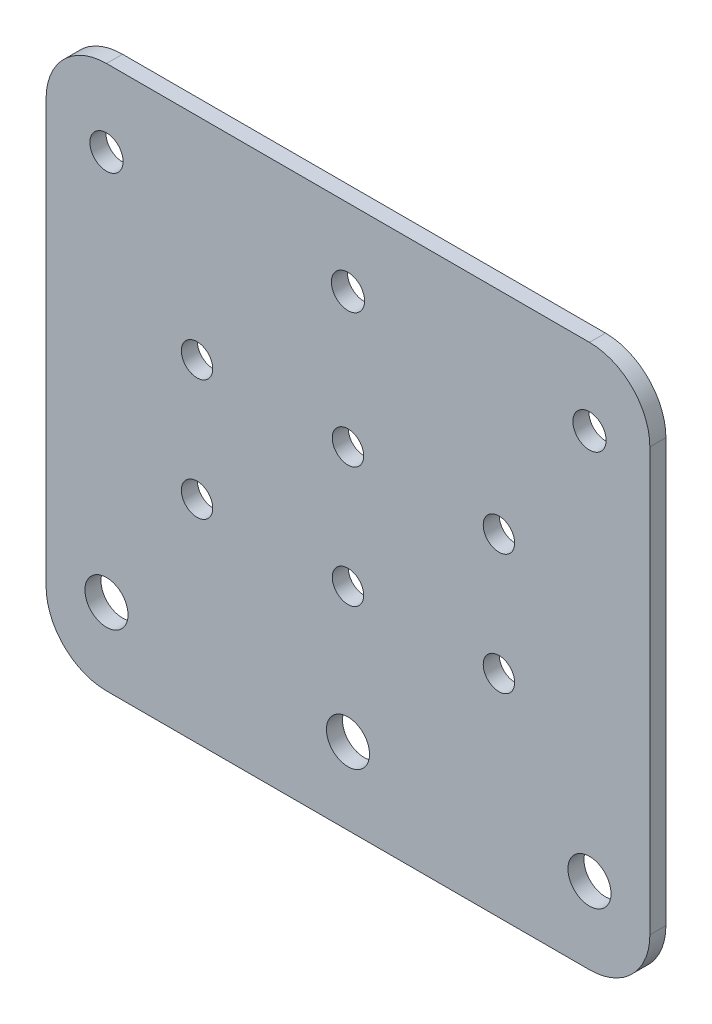
ISO-10303-21;
HEADER;
FILE_DESCRIPTION(('STEP AP214'),'2;1');
FILE_NAME('part.step','',(''),(''),'','','');
FILE_SCHEMA(('AUTOMOTIVE_DESIGN { 1 0 10303 214 1 1 1 1 }'));
ENDSEC;
DATA;
#1=APPLICATION_CONTEXT('core data for automotive mechanical design processes');
#2=APPLICATION_PROTOCOL_DEFINITION('international standard','automotive_design',2000,#1);
#3=PRODUCT_CONTEXT('',#1,'mechanical');
#4=PRODUCT('Part','Part','',(#3));
#5=PRODUCT_RELATED_PRODUCT_CATEGORY('part','',(#4));
#6=PRODUCT_DEFINITION_FORMATION('','',#4);
#7=PRODUCT_DEFINITION_CONTEXT('part definition',#1,'design');
#8=PRODUCT_DEFINITION('design','',#6,#7);
#9=PRODUCT_DEFINITION_SHAPE('','',#8);
#10=(LENGTH_UNIT() NAMED_UNIT(*) SI_UNIT(.MILLI.,.METRE.));
#11=(NAMED_UNIT(*) PLANE_ANGLE_UNIT() SI_UNIT($,.RADIAN.));
#12=(NAMED_UNIT(*) SI_UNIT($,.STERADIAN.) SOLID_ANGLE_UNIT());
#13=UNCERTAINTY_MEASURE_WITH_UNIT(LENGTH_MEASURE(1.E-05),#10,'distance_accuracy_value','');
#14=(GEOMETRIC_REPRESENTATION_CONTEXT(3) GLOBAL_UNCERTAINTY_ASSIGNED_CONTEXT((#13)) GLOBAL_UNIT_ASSIGNED_CONTEXT((#10,
#11,#12)) REPRESENTATION_CONTEXT('',''));
#15=CARTESIAN_POINT('',(0.,0.,0.));
#16=DIRECTION('',(0.,0.,1.));
#17=DIRECTION('',(1.,0.,0.));
#18=AXIS2_PLACEMENT_3D('',#15,#16,#17);
#19=CARTESIAN_POINT('',(0.,0.,2.65684));
#20=DIRECTION('',(0.,0.,1.));
#21=DIRECTION('',(1.,0.,0.));
#22=AXIS2_PLACEMENT_3D('',#19,#20,#21);
#23=PLANE('',#22);
#24=CARTESIAN_POINT('',(-40.,35.,2.65684));
#25=DIRECTION('',(0.,0.,1.));
#26=DIRECTION('',(1.,0.,0.));
#27=AXIS2_PLACEMENT_3D('',#24,#25,#26);
#28=CIRCLE('',#27,10.);
#29=CARTESIAN_POINT('',(-50.,35.,2.65684));
#30=VERTEX_POINT('',#29);
#31=CARTESIAN_POINT('',(-40.,45.,2.65684));
#32=VERTEX_POINT('',#31);
#33=EDGE_CURVE('E166',#30,#32,#28,.F.);
#34=ORIENTED_EDGE('',*,*,#33,.F.);
#35=DIRECTION('',(0.,1.,0.));
#36=VECTOR('',#35,1.);
#37=CARTESIAN_POINT('',(-50.,-45.,2.65684));
#38=LINE('',#37,#36);
#39=CARTESIAN_POINT('',(-50.,-35.,2.65684));
#40=VERTEX_POINT('',#39);
#41=EDGE_CURVE('E108',#40,#30,#38,.T.);
#42=ORIENTED_EDGE('',*,*,#41,.F.);
#43=CARTESIAN_POINT('',(-40.,-35.,2.65684));
#44=DIRECTION('',(0.,0.,1.));
#45=DIRECTION('',(1.,0.,0.));
#46=AXIS2_PLACEMENT_3D('',#43,#44,#45);
#47=CIRCLE('',#46,10.);
#48=CARTESIAN_POINT('',(-40.,-45.,2.65684));
#49=VERTEX_POINT('',#48);
#50=EDGE_CURVE('E94',#49,#40,#47,.F.);
#51=ORIENTED_EDGE('',*,*,#50,.F.);
#52=DIRECTION('',(1.,0.,0.));
#53=VECTOR('',#52,1.);
#54=CARTESIAN_POINT('',(50.,-45.,2.65684));
#55=LINE('',#54,#53);
#56=CARTESIAN_POINT('',(40.,-45.,2.65684));
#57=VERTEX_POINT('',#56);
#58=EDGE_CURVE('E88',#57,#49,#55,.F.);
#59=ORIENTED_EDGE('',*,*,#58,.F.);
#60=CARTESIAN_POINT('',(40.,-35.,2.65684));
#61=DIRECTION('',(0.,0.,1.));
#62=DIRECTION('',(1.,0.,0.));
#63=AXIS2_PLACEMENT_3D('',#60,#61,#62);
#64=CIRCLE('',#63,10.);
#65=CARTESIAN_POINT('',(50.,-35.,2.65684));
#66=VERTEX_POINT('',#65);
#67=EDGE_CURVE('E78',#66,#57,#64,.F.);
#68=ORIENTED_EDGE('',*,*,#67,.F.);
#69=DIRECTION('',(0.,1.,0.));
#70=VECTOR('',#69,1.);
#71=CARTESIAN_POINT('',(50.,45.,2.65684));
#72=LINE('',#71,#70);
#73=CARTESIAN_POINT('',(50.,35.,2.65684));
#74=VERTEX_POINT('',#73);
#75=EDGE_CURVE('E104',#74,#66,#72,.F.);
#76=ORIENTED_EDGE('',*,*,#75,.F.);
#77=CARTESIAN_POINT('',(40.,35.,2.65684));
#78=DIRECTION('',(0.,0.,1.));
#79=DIRECTION('',(1.,0.,0.));
#80=AXIS2_PLACEMENT_3D('',#77,#78,#79);
#81=CIRCLE('',#80,10.);
#82=CARTESIAN_POINT('',(40.,45.,2.65684));
#83=VERTEX_POINT('',#82);
#84=EDGE_CURVE('E116',#83,#74,#81,.F.);
#85=ORIENTED_EDGE('',*,*,#84,.F.);
#86=DIRECTION('',(-1.,0.,0.));
#87=VECTOR('',#86,1.);
#88=CARTESIAN_POINT('',(-50.,45.,2.65684));
#89=LINE('',#88,#87);
#90=EDGE_CURVE('E112',#32,#83,#89,.F.);
#91=ORIENTED_EDGE('',*,*,#90,.F.);
#92=EDGE_LOOP('',(#34,#42,#51,#59,#68,#76,#85,#91));
#93=FACE_BOUND('',#92,.T.);
#94=CARTESIAN_POINT('',(40.,32.3,2.65684));
#95=DIRECTION('',(0.,0.,-1.));
#96=DIRECTION('',(-1.,0.,0.));
#97=AXIS2_PLACEMENT_3D('',#94,#95,#96);
#98=CIRCLE('',#97,2.75);
#99=CARTESIAN_POINT('',(37.25,32.3,2.65684));
#100=VERTEX_POINT('',#99);
#101=EDGE_CURVE('E98',#100,#100,#98,.T.);
#102=ORIENTED_EDGE('',*,*,#101,.T.);
#103=EDGE_LOOP('',(#102));
#104=FACE_BOUND('',#103,.T.);
#105=CARTESIAN_POINT('',(40.,-32.3,2.65684));
#106=DIRECTION('',(0.,0.,-1.));
#107=DIRECTION('',(-1.,0.,0.));
#108=AXIS2_PLACEMENT_3D('',#105,#106,#107);
#109=CIRCLE('',#108,3.5685);
#110=CARTESIAN_POINT('',(36.4315,-32.3,2.65684));
#111=VERTEX_POINT('',#110);
#112=EDGE_CURVE('E171',#111,#111,#109,.T.);
#113=ORIENTED_EDGE('',*,*,#112,.T.);
#114=EDGE_LOOP('',(#113));
#115=FACE_BOUND('',#114,.T.);
#116=CARTESIAN_POINT('',(0.,32.3,2.65684));
#117=DIRECTION('',(0.,0.,-1.));
#118=DIRECTION('',(-1.,0.,0.));
#119=AXIS2_PLACEMENT_3D('',#116,#117,#118);
#120=CIRCLE('',#119,2.75);
#121=CARTESIAN_POINT('',(-2.74999999999999,32.3,2.65684));
#122=VERTEX_POINT('',#121);
#123=EDGE_CURVE('E174',#122,#122,#120,.T.);
#124=ORIENTED_EDGE('',*,*,#123,.T.);
#125=EDGE_LOOP('',(#124));
#126=FACE_BOUND('',#125,.T.);
#127=CARTESIAN_POINT('',(0.,-32.3,2.65684));
#128=DIRECTION('',(0.,0.,-1.));
#129=DIRECTION('',(-1.,0.,0.));
#130=AXIS2_PLACEMENT_3D('',#127,#128,#129);
#131=CIRCLE('',#130,3.5685);
#132=CARTESIAN_POINT('',(-3.5685,-32.3,2.65684));
#133=VERTEX_POINT('',#132);
#134=EDGE_CURVE('E177',#133,#133,#131,.T.);
#135=ORIENTED_EDGE('',*,*,#134,.T.);
#136=EDGE_LOOP('',(#135));
#137=FACE_BOUND('',#136,.T.);
#138=CARTESIAN_POINT('',(-40.,32.3,2.65684));
#139=DIRECTION('',(0.,0.,-1.));
#140=DIRECTION('',(-1.,0.,0.));
#141=AXIS2_PLACEMENT_3D('',#138,#139,#140);
#142=CIRCLE('',#141,2.75);
#143=CARTESIAN_POINT('',(-42.75,32.3,2.65684));
#144=VERTEX_POINT('',#143);
#145=EDGE_CURVE('E180',#144,#144,#142,.T.);
#146=ORIENTED_EDGE('',*,*,#145,.T.);
#147=EDGE_LOOP('',(#146));
#148=FACE_BOUND('',#147,.T.);
#149=CARTESIAN_POINT('',(-40.,-32.3,2.65684));
#150=DIRECTION('',(0.,0.,-1.));
#151=DIRECTION('',(-1.,0.,0.));
#152=AXIS2_PLACEMENT_3D('',#149,#150,#151);
#153=CIRCLE('',#152,3.5685);
#154=CARTESIAN_POINT('',(-43.5685,-32.3,2.65684));
#155=VERTEX_POINT('',#154);
#156=EDGE_CURVE('E183',#155,#155,#153,.T.);
#157=ORIENTED_EDGE('',*,*,#156,.T.);
#158=EDGE_LOOP('',(#157));
#159=FACE_BOUND('',#158,.T.);
#160=CARTESIAN_POINT('',(-25.,-10.,2.65684));
#161=DIRECTION('',(0.,0.,-1.));
#162=DIRECTION('',(-1.,0.,0.));
#163=AXIS2_PLACEMENT_3D('',#160,#161,#162);
#164=CIRCLE('',#163,2.6);
#165=CARTESIAN_POINT('',(-27.6,-10.,2.65684));
#166=VERTEX_POINT('',#165);
#167=EDGE_CURVE('E186',#166,#166,#164,.T.);
#168=ORIENTED_EDGE('',*,*,#167,.T.);
#169=EDGE_LOOP('',(#168));
#170=FACE_BOUND('',#169,.T.);
#171=CARTESIAN_POINT('',(0.,-10.,2.65684));
#172=DIRECTION('',(0.,0.,-1.));
#173=DIRECTION('',(-1.,0.,0.));
#174=AXIS2_PLACEMENT_3D('',#171,#172,#173);
#175=CIRCLE('',#174,2.6);
#176=CARTESIAN_POINT('',(-2.6,-10.,2.65684));
#177=VERTEX_POINT('',#176);
#178=EDGE_CURVE('E189',#177,#177,#175,.T.);
#179=ORIENTED_EDGE('',*,*,#178,.T.);
#180=EDGE_LOOP('',(#179));
#181=FACE_BOUND('',#180,.T.);
#182=CARTESIAN_POINT('',(25.,-10.,2.65684));
#183=DIRECTION('',(0.,0.,-1.));
#184=DIRECTION('',(-1.,0.,0.));
#185=AXIS2_PLACEMENT_3D('',#182,#183,#184);
#186=CIRCLE('',#185,2.6);
#187=CARTESIAN_POINT('',(22.4,-10.,2.65684));
#188=VERTEX_POINT('',#187);
#189=EDGE_CURVE('E192',#188,#188,#186,.T.);
#190=ORIENTED_EDGE('',*,*,#189,.T.);
#191=EDGE_LOOP('',(#190));
#192=FACE_BOUND('',#191,.T.);
#193=CARTESIAN_POINT('',(-25.,10.,2.65684));
#194=DIRECTION('',(0.,0.,-1.));
#195=DIRECTION('',(-1.,0.,0.));
#196=AXIS2_PLACEMENT_3D('',#193,#194,#195);
#197=CIRCLE('',#196,2.6);
#198=CARTESIAN_POINT('',(-27.6,10.,2.65684));
#199=VERTEX_POINT('',#198);
#200=EDGE_CURVE('E195',#199,#199,#197,.T.);
#201=ORIENTED_EDGE('',*,*,#200,.T.);
#202=EDGE_LOOP('',(#201));
#203=FACE_BOUND('',#202,.T.);
#204=CARTESIAN_POINT('',(0.,10.,2.65684));
#205=DIRECTION('',(0.,0.,-1.));
#206=DIRECTION('',(-1.,0.,0.));
#207=AXIS2_PLACEMENT_3D('',#204,#205,#206);
#208=CIRCLE('',#207,2.6);
#209=CARTESIAN_POINT('',(-2.6,10.,2.65684));
#210=VERTEX_POINT('',#209);
#211=EDGE_CURVE('E197',#210,#210,#208,.T.);
#212=ORIENTED_EDGE('',*,*,#211,.T.);
#213=EDGE_LOOP('',(#212));
#214=FACE_BOUND('',#213,.T.);
#215=CARTESIAN_POINT('',(25.,9.99999999999999,2.65684));
#216=DIRECTION('',(0.,0.,-1.));
#217=DIRECTION('',(-1.,0.,0.));
#218=AXIS2_PLACEMENT_3D('',#215,#216,#217);
#219=CIRCLE('',#218,2.6);
#220=CARTESIAN_POINT('',(22.4,9.99999999999999,2.65684));
#221=VERTEX_POINT('',#220);
#222=EDGE_CURVE('E19',#221,#221,#219,.T.);
#223=ORIENTED_EDGE('',*,*,#222,.T.);
#224=EDGE_LOOP('',(#223));
#225=FACE_BOUND('',#224,.T.);
#226=ADVANCED_FACE('F16',(#93,#104,#115,#126,#137,#148,#159,#170,#181,#192,#203,#214,#225),#23,.T.);
#227=CARTESIAN_POINT('',(25.,9.99999999999999,2.65684));
#228=DIRECTION('',(0.,0.,-1.));
#229=DIRECTION('',(-1.,0.,0.));
#230=AXIS2_PLACEMENT_3D('',#227,#228,#229);
#231=CYLINDRICAL_SURFACE('',#230,2.6);
#232=ORIENTED_EDGE('',*,*,#222,.F.);
#233=EDGE_LOOP('',(#232));
#234=FACE_BOUND('',#233,.T.);
#235=CARTESIAN_POINT('',(25.,9.99999999999999,0.));
#236=DIRECTION('',(0.,0.,-1.));
#237=DIRECTION('',(-1.,0.,0.));
#238=AXIS2_PLACEMENT_3D('',#235,#236,#237);
#239=CIRCLE('',#238,2.6);
#240=CARTESIAN_POINT('',(22.4,9.99999999999999,0.));
#241=VERTEX_POINT('',#240);
#242=EDGE_CURVE('E161',#241,#241,#239,.T.);
#243=ORIENTED_EDGE('',*,*,#242,.T.);
#244=EDGE_LOOP('',(#243));
#245=FACE_BOUND('',#244,.T.);
#246=ADVANCED_FACE('F205',(#234,#245),#231,.F.);
#247=CARTESIAN_POINT('',(0.,10.,2.65684));
#248=DIRECTION('',(0.,0.,-1.));
#249=DIRECTION('',(-1.,0.,0.));
#250=AXIS2_PLACEMENT_3D('',#247,#248,#249);
#251=CYLINDRICAL_SURFACE('',#250,2.6);
#252=ORIENTED_EDGE('',*,*,#211,.F.);
#253=EDGE_LOOP('',(#252));
#254=FACE_BOUND('',#253,.T.);
#255=CARTESIAN_POINT('',(0.,10.,0.));
#256=DIRECTION('',(0.,0.,-1.));
#257=DIRECTION('',(-1.,0.,0.));
#258=AXIS2_PLACEMENT_3D('',#255,#256,#257);
#259=CIRCLE('',#258,2.6);
#260=CARTESIAN_POINT('',(-2.6,10.,0.));
#261=VERTEX_POINT('',#260);
#262=EDGE_CURVE('E158',#261,#261,#259,.T.);
#263=ORIENTED_EDGE('',*,*,#262,.T.);
#264=EDGE_LOOP('',(#263));
#265=FACE_BOUND('',#264,.T.);
#266=ADVANCED_FACE('F208',(#254,#265),#251,.F.);
#267=CARTESIAN_POINT('',(-25.,10.,2.65684));
#268=DIRECTION('',(0.,0.,-1.));
#269=DIRECTION('',(-1.,0.,0.));
#270=AXIS2_PLACEMENT_3D('',#267,#268,#269);
#271=CYLINDRICAL_SURFACE('',#270,2.6);
#272=ORIENTED_EDGE('',*,*,#200,.F.);
#273=EDGE_LOOP('',(#272));
#274=FACE_BOUND('',#273,.T.);
#275=CARTESIAN_POINT('',(-25.,10.,0.));
#276=DIRECTION('',(0.,0.,-1.));
#277=DIRECTION('',(-1.,0.,0.));
#278=AXIS2_PLACEMENT_3D('',#275,#276,#277);
#279=CIRCLE('',#278,2.6);
#280=CARTESIAN_POINT('',(-27.6,10.,0.));
#281=VERTEX_POINT('',#280);
#282=EDGE_CURVE('E155',#281,#281,#279,.T.);
#283=ORIENTED_EDGE('',*,*,#282,.T.);
#284=EDGE_LOOP('',(#283));
#285=FACE_BOUND('',#284,.T.);
#286=ADVANCED_FACE('F283',(#274,#285),#271,.F.);
#287=CARTESIAN_POINT('',(25.,-10.,2.65684));
#288=DIRECTION('',(0.,0.,-1.));
#289=DIRECTION('',(-1.,0.,0.));
#290=AXIS2_PLACEMENT_3D('',#287,#288,#289);
#291=CYLINDRICAL_SURFACE('',#290,2.6);
#292=ORIENTED_EDGE('',*,*,#189,.F.);
#293=EDGE_LOOP('',(#292));
#294=FACE_BOUND('',#293,.T.);
#295=CARTESIAN_POINT('',(25.,-10.,0.));
#296=DIRECTION('',(0.,0.,-1.));
#297=DIRECTION('',(-1.,0.,0.));
#298=AXIS2_PLACEMENT_3D('',#295,#296,#297);
#299=CIRCLE('',#298,2.6);
#300=CARTESIAN_POINT('',(22.4,-10.,0.));
#301=VERTEX_POINT('',#300);
#302=EDGE_CURVE('E152',#301,#301,#299,.T.);
#303=ORIENTED_EDGE('',*,*,#302,.T.);
#304=EDGE_LOOP('',(#303));
#305=FACE_BOUND('',#304,.T.);
#306=ADVANCED_FACE('F279',(#294,#305),#291,.F.);
#307=CARTESIAN_POINT('',(0.,-10.,2.65684));
#308=DIRECTION('',(0.,0.,-1.));
#309=DIRECTION('',(-1.,0.,0.));
#310=AXIS2_PLACEMENT_3D('',#307,#308,#309);
#311=CYLINDRICAL_SURFACE('',#310,2.6);
#312=ORIENTED_EDGE('',*,*,#178,.F.);
#313=EDGE_LOOP('',(#312));
#314=FACE_BOUND('',#313,.T.);
#315=CARTESIAN_POINT('',(0.,-10.,0.));
#316=DIRECTION('',(0.,0.,-1.));
#317=DIRECTION('',(-1.,0.,0.));
#318=AXIS2_PLACEMENT_3D('',#315,#316,#317);
#319=CIRCLE('',#318,2.6);
#320=CARTESIAN_POINT('',(-2.6,-10.,0.));
#321=VERTEX_POINT('',#320);
#322=EDGE_CURVE('E149',#321,#321,#319,.T.);
#323=ORIENTED_EDGE('',*,*,#322,.T.);
#324=EDGE_LOOP('',(#323));
#325=FACE_BOUND('',#324,.T.);
#326=ADVANCED_FACE('F275',(#314,#325),#311,.F.);
#327=CARTESIAN_POINT('',(-25.,-10.,2.65684));
#328=DIRECTION('',(0.,0.,-1.));
#329=DIRECTION('',(-1.,0.,0.));
#330=AXIS2_PLACEMENT_3D('',#327,#328,#329);
#331=CYLINDRICAL_SURFACE('',#330,2.6);
#332=ORIENTED_EDGE('',*,*,#167,.F.);
#333=EDGE_LOOP('',(#332));
#334=FACE_BOUND('',#333,.T.);
#335=CARTESIAN_POINT('',(-25.,-10.,0.));
#336=DIRECTION('',(0.,0.,-1.));
#337=DIRECTION('',(-1.,0.,0.));
#338=AXIS2_PLACEMENT_3D('',#335,#336,#337);
#339=CIRCLE('',#338,2.6);
#340=CARTESIAN_POINT('',(-27.6,-10.,0.));
#341=VERTEX_POINT('',#340);
#342=EDGE_CURVE('E146',#341,#341,#339,.T.);
#343=ORIENTED_EDGE('',*,*,#342,.T.);
#344=EDGE_LOOP('',(#343));
#345=FACE_BOUND('',#344,.T.);
#346=ADVANCED_FACE('F271',(#334,#345),#331,.F.);
#347=CARTESIAN_POINT('',(-40.,-32.3,2.65684));
#348=DIRECTION('',(0.,0.,-1.));
#349=DIRECTION('',(-1.,0.,0.));
#350=AXIS2_PLACEMENT_3D('',#347,#348,#349);
#351=CYLINDRICAL_SURFACE('',#350,3.5685);
#352=ORIENTED_EDGE('',*,*,#156,.F.);
#353=EDGE_LOOP('',(#352));
#354=FACE_BOUND('',#353,.T.);
#355=CARTESIAN_POINT('',(-40.,-32.3,0.));
#356=DIRECTION('',(0.,0.,-1.));
#357=DIRECTION('',(-1.,0.,0.));
#358=AXIS2_PLACEMENT_3D('',#355,#356,#357);
#359=CIRCLE('',#358,3.5685);
#360=CARTESIAN_POINT('',(-43.5685,-32.3,0.));
#361=VERTEX_POINT('',#360);
#362=EDGE_CURVE('E143',#361,#361,#359,.T.);
#363=ORIENTED_EDGE('',*,*,#362,.T.);
#364=EDGE_LOOP('',(#363));
#365=FACE_BOUND('',#364,.T.);
#366=ADVANCED_FACE('F267',(#354,#365),#351,.F.);
#367=CARTESIAN_POINT('',(-40.,32.3,2.65684));
#368=DIRECTION('',(0.,0.,-1.));
#369=DIRECTION('',(-1.,0.,0.));
#370=AXIS2_PLACEMENT_3D('',#367,#368,#369);
#371=CYLINDRICAL_SURFACE('',#370,2.75);
#372=ORIENTED_EDGE('',*,*,#145,.F.);
#373=EDGE_LOOP('',(#372));
#374=FACE_BOUND('',#373,.T.);
#375=CARTESIAN_POINT('',(-40.,32.3,0.));
#376=DIRECTION('',(0.,0.,-1.));
#377=DIRECTION('',(-1.,0.,0.));
#378=AXIS2_PLACEMENT_3D('',#375,#376,#377);
#379=CIRCLE('',#378,2.75);
#380=CARTESIAN_POINT('',(-42.75,32.3,0.));
#381=VERTEX_POINT('',#380);
#382=EDGE_CURVE('E140',#381,#381,#379,.T.);
#383=ORIENTED_EDGE('',*,*,#382,.T.);
#384=EDGE_LOOP('',(#383));
#385=FACE_BOUND('',#384,.T.);
#386=ADVANCED_FACE('F263',(#374,#385),#371,.F.);
#387=CARTESIAN_POINT('',(0.,-32.3,2.65684));
#388=DIRECTION('',(0.,0.,-1.));
#389=DIRECTION('',(-1.,0.,0.));
#390=AXIS2_PLACEMENT_3D('',#387,#388,#389);
#391=CYLINDRICAL_SURFACE('',#390,3.5685);
#392=ORIENTED_EDGE('',*,*,#134,.F.);
#393=EDGE_LOOP('',(#392));
#394=FACE_BOUND('',#393,.T.);
#395=CARTESIAN_POINT('',(0.,-32.3,0.));
#396=DIRECTION('',(0.,0.,-1.));
#397=DIRECTION('',(-1.,0.,0.));
#398=AXIS2_PLACEMENT_3D('',#395,#396,#397);
#399=CIRCLE('',#398,3.5685);
#400=CARTESIAN_POINT('',(-3.5685,-32.3,0.));
#401=VERTEX_POINT('',#400);
#402=EDGE_CURVE('E137',#401,#401,#399,.T.);
#403=ORIENTED_EDGE('',*,*,#402,.T.);
#404=EDGE_LOOP('',(#403));
#405=FACE_BOUND('',#404,.T.);
#406=ADVANCED_FACE('F259',(#394,#405),#391,.F.);
#407=CARTESIAN_POINT('',(0.,32.3,2.65684));
#408=DIRECTION('',(0.,0.,-1.));
#409=DIRECTION('',(-1.,0.,0.));
#410=AXIS2_PLACEMENT_3D('',#407,#408,#409);
#411=CYLINDRICAL_SURFACE('',#410,2.75);
#412=ORIENTED_EDGE('',*,*,#123,.F.);
#413=EDGE_LOOP('',(#412));
#414=FACE_BOUND('',#413,.T.);
#415=CARTESIAN_POINT('',(0.,32.3,0.));
#416=DIRECTION('',(0.,0.,-1.));
#417=DIRECTION('',(-1.,0.,0.));
#418=AXIS2_PLACEMENT_3D('',#415,#416,#417);
#419=CIRCLE('',#418,2.75);
#420=CARTESIAN_POINT('',(-2.74999999999999,32.3,0.));
#421=VERTEX_POINT('',#420);
#422=EDGE_CURVE('E134',#421,#421,#419,.T.);
#423=ORIENTED_EDGE('',*,*,#422,.T.);
#424=EDGE_LOOP('',(#423));
#425=FACE_BOUND('',#424,.T.);
#426=ADVANCED_FACE('F255',(#414,#425),#411,.F.);
#427=CARTESIAN_POINT('',(40.,-32.3,2.65684));
#428=DIRECTION('',(0.,0.,-1.));
#429=DIRECTION('',(-1.,0.,0.));
#430=AXIS2_PLACEMENT_3D('',#427,#428,#429);
#431=CYLINDRICAL_SURFACE('',#430,3.5685);
#432=ORIENTED_EDGE('',*,*,#112,.F.);
#433=EDGE_LOOP('',(#432));
#434=FACE_BOUND('',#433,.T.);
#435=CARTESIAN_POINT('',(40.,-32.3,0.));
#436=DIRECTION('',(0.,0.,-1.));
#437=DIRECTION('',(-1.,0.,0.));
#438=AXIS2_PLACEMENT_3D('',#435,#436,#437);
#439=CIRCLE('',#438,3.5685);
#440=CARTESIAN_POINT('',(36.4315,-32.3,0.));
#441=VERTEX_POINT('',#440);
#442=EDGE_CURVE('E131',#441,#441,#439,.T.);
#443=ORIENTED_EDGE('',*,*,#442,.T.);
#444=EDGE_LOOP('',(#443));
#445=FACE_BOUND('',#444,.T.);
#446=ADVANCED_FACE('F251',(#434,#445),#431,.F.);
#447=CARTESIAN_POINT('',(40.,32.3,2.65684));
#448=DIRECTION('',(0.,0.,-1.));
#449=DIRECTION('',(-1.,0.,0.));
#450=AXIS2_PLACEMENT_3D('',#447,#448,#449);
#451=CYLINDRICAL_SURFACE('',#450,2.75);
#452=ORIENTED_EDGE('',*,*,#101,.F.);
#453=EDGE_LOOP('',(#452));
#454=FACE_BOUND('',#453,.T.);
#455=CARTESIAN_POINT('',(40.,32.3,0.));
#456=DIRECTION('',(0.,0.,-1.));
#457=DIRECTION('',(-1.,0.,0.));
#458=AXIS2_PLACEMENT_3D('',#455,#456,#457);
#459=CIRCLE('',#458,2.75);
#460=CARTESIAN_POINT('',(37.25,32.3,0.));
#461=VERTEX_POINT('',#460);
#462=EDGE_CURVE('E128',#461,#461,#459,.T.);
#463=ORIENTED_EDGE('',*,*,#462,.T.);
#464=EDGE_LOOP('',(#463));
#465=FACE_BOUND('',#464,.T.);
#466=ADVANCED_FACE('F248',(#454,#465),#451,.F.);
#467=CARTESIAN_POINT('',(50.,-45.,0.));
#468=DIRECTION('',(0.,-1.,0.));
#469=DIRECTION('',(1.,0.,0.));
#470=AXIS2_PLACEMENT_3D('',#467,#468,#469);
#471=PLANE('',#470);
#472=DIRECTION('',(0.,0.,1.));
#473=VECTOR('',#472,1.);
#474=CARTESIAN_POINT('',(40.,-45.,0.));
#475=LINE('',#474,#473);
#476=CARTESIAN_POINT('',(40.,-45.,0.));
#477=VERTEX_POINT('',#476);
#478=EDGE_CURVE('E85',#57,#477,#475,.F.);
#479=ORIENTED_EDGE('',*,*,#478,.F.);
#480=ORIENTED_EDGE('',*,*,#58,.T.);
#481=DIRECTION('',(0.,0.,1.));
#482=VECTOR('',#481,1.);
#483=CARTESIAN_POINT('',(-40.,-45.,0.));
#484=LINE('',#483,#482);
#485=CARTESIAN_POINT('',(-40.,-45.,0.));
#486=VERTEX_POINT('',#485);
#487=EDGE_CURVE('E164',#486,#49,#484,.T.);
#488=ORIENTED_EDGE('',*,*,#487,.F.);
#489=DIRECTION('',(1.,0.,0.));
#490=VECTOR('',#489,1.);
#491=CARTESIAN_POINT('',(0.,-45.,0.));
#492=LINE('',#491,#490);
#493=EDGE_CURVE('E102',#486,#477,#492,.T.);
#494=ORIENTED_EDGE('',*,*,#493,.T.);
#495=EDGE_LOOP('',(#479,#480,#488,#494));
#496=FACE_BOUND('',#495,.T.);
#497=ADVANCED_FACE('F101',(#496),#471,.T.);
#498=CARTESIAN_POINT('',(40.,-35.,0.));
#499=DIRECTION('',(0.,0.,1.));
#500=DIRECTION('',(1.,0.,0.));
#501=AXIS2_PLACEMENT_3D('',#498,#499,#500);
#502=CYLINDRICAL_SURFACE('',#501,10.);
#503=CARTESIAN_POINT('',(40.,-35.,0.));
#504=DIRECTION('',(0.,0.,1.));
#505=DIRECTION('',(1.,0.,0.));
#506=AXIS2_PLACEMENT_3D('',#503,#504,#505);
#507=CIRCLE('',#506,10.);
#508=CARTESIAN_POINT('',(50.,-35.,0.));
#509=VERTEX_POINT('',#508);
#510=EDGE_CURVE('E126',#477,#509,#507,.T.);
#511=ORIENTED_EDGE('',*,*,#510,.T.);
#512=DIRECTION('',(0.,0.,1.));
#513=VECTOR('',#512,1.);
#514=CARTESIAN_POINT('',(50.,-35.,0.));
#515=LINE('',#514,#513);
#516=EDGE_CURVE('E87',#66,#509,#515,.F.);
#517=ORIENTED_EDGE('',*,*,#516,.F.);
#518=ORIENTED_EDGE('',*,*,#67,.T.);
#519=ORIENTED_EDGE('',*,*,#478,.T.);
#520=EDGE_LOOP('',(#511,#517,#518,#519));
#521=FACE_BOUND('',#520,.T.);
#522=ADVANCED_FACE('F83',(#521),#502,.T.);
#523=CARTESIAN_POINT('',(50.,45.,0.));
#524=DIRECTION('',(1.,0.,0.));
#525=DIRECTION('',(0.,1.,0.));
#526=AXIS2_PLACEMENT_3D('',#523,#524,#525);
#527=PLANE('',#526);
#528=DIRECTION('',(0.,0.,1.));
#529=VECTOR('',#528,1.);
#530=CARTESIAN_POINT('',(50.,35.,0.));
#531=LINE('',#530,#529);
#532=CARTESIAN_POINT('',(50.,35.,0.));
#533=VERTEX_POINT('',#532);
#534=EDGE_CURVE('E115',#74,#533,#531,.F.);
#535=ORIENTED_EDGE('',*,*,#534,.F.);
#536=ORIENTED_EDGE('',*,*,#75,.T.);
#537=ORIENTED_EDGE('',*,*,#516,.T.);
#538=DIRECTION('',(0.,1.,0.));
#539=VECTOR('',#538,1.);
#540=CARTESIAN_POINT('',(50.,0.,0.));
#541=LINE('',#540,#539);
#542=EDGE_CURVE('E125',#509,#533,#541,.T.);
#543=ORIENTED_EDGE('',*,*,#542,.T.);
#544=EDGE_LOOP('',(#535,#536,#537,#543));
#545=FACE_BOUND('',#544,.T.);
#546=ADVANCED_FACE('F239',(#545),#527,.T.);
#547=CARTESIAN_POINT('',(40.,35.,0.));
#548=DIRECTION('',(0.,0.,1.));
#549=DIRECTION('',(1.,0.,0.));
#550=AXIS2_PLACEMENT_3D('',#547,#548,#549);
#551=CYLINDRICAL_SURFACE('',#550,10.);
#552=CARTESIAN_POINT('',(40.,35.,0.));
#553=DIRECTION('',(0.,0.,1.));
#554=DIRECTION('',(1.,0.,0.));
#555=AXIS2_PLACEMENT_3D('',#552,#553,#554);
#556=CIRCLE('',#555,10.);
#557=CARTESIAN_POINT('',(40.,45.,0.));
#558=VERTEX_POINT('',#557);
#559=EDGE_CURVE('E122',#533,#558,#556,.T.);
#560=ORIENTED_EDGE('',*,*,#559,.T.);
#561=DIRECTION('',(0.,0.,1.));
#562=VECTOR('',#561,1.);
#563=CARTESIAN_POINT('',(40.,45.,0.));
#564=LINE('',#563,#562);
#565=EDGE_CURVE('E114',#83,#558,#564,.F.);
#566=ORIENTED_EDGE('',*,*,#565,.F.);
#567=ORIENTED_EDGE('',*,*,#84,.T.);
#568=ORIENTED_EDGE('',*,*,#534,.T.);
#569=EDGE_LOOP('',(#560,#566,#567,#568));
#570=FACE_BOUND('',#569,.T.);
#571=ADVANCED_FACE('F235',(#570),#551,.T.);
#572=CARTESIAN_POINT('',(-50.,45.,0.));
#573=DIRECTION('',(0.,1.,0.));
#574=DIRECTION('',(-1.,0.,0.));
#575=AXIS2_PLACEMENT_3D('',#572,#573,#574);
#576=PLANE('',#575);
#577=ORIENTED_EDGE('',*,*,#565,.T.);
#578=DIRECTION('',(1.,0.,0.));
#579=VECTOR('',#578,1.);
#580=CARTESIAN_POINT('',(0.,45.,0.));
#581=LINE('',#580,#579);
#582=CARTESIAN_POINT('',(-40.,45.,0.));
#583=VERTEX_POINT('',#582);
#584=EDGE_CURVE('E121',#558,#583,#581,.F.);
#585=ORIENTED_EDGE('',*,*,#584,.T.);
#586=DIRECTION('',(0.,0.,1.));
#587=VECTOR('',#586,1.);
#588=CARTESIAN_POINT('',(-40.,45.,0.));
#589=LINE('',#588,#587);
#590=EDGE_CURVE('E111',#32,#583,#589,.F.);
#591=ORIENTED_EDGE('',*,*,#590,.F.);
#592=ORIENTED_EDGE('',*,*,#90,.T.);
#593=EDGE_LOOP('',(#577,#585,#591,#592));
#594=FACE_BOUND('',#593,.T.);
#595=ADVANCED_FACE('F231',(#594),#576,.T.);
#596=CARTESIAN_POINT('',(-40.,35.,0.));
#597=DIRECTION('',(0.,0.,1.));
#598=DIRECTION('',(1.,0.,0.));
#599=AXIS2_PLACEMENT_3D('',#596,#597,#598);
#600=CYLINDRICAL_SURFACE('',#599,10.);
#601=CARTESIAN_POINT('',(-40.,35.,0.));
#602=DIRECTION('',(0.,0.,1.));
#603=DIRECTION('',(1.,0.,0.));
#604=AXIS2_PLACEMENT_3D('',#601,#602,#603);
#605=CIRCLE('',#604,10.);
#606=CARTESIAN_POINT('',(-50.,35.,0.));
#607=VERTEX_POINT('',#606);
#608=EDGE_CURVE('E118',#583,#607,#605,.T.);
#609=ORIENTED_EDGE('',*,*,#608,.T.);
#610=DIRECTION('',(0.,0.,1.));
#611=VECTOR('',#610,1.);
#612=CARTESIAN_POINT('',(-50.,35.,0.));
#613=LINE('',#612,#611);
#614=EDGE_CURVE('E110',#30,#607,#613,.F.);
#615=ORIENTED_EDGE('',*,*,#614,.F.);
#616=ORIENTED_EDGE('',*,*,#33,.T.);
#617=ORIENTED_EDGE('',*,*,#590,.T.);
#618=EDGE_LOOP('',(#609,#615,#616,#617));
#619=FACE_BOUND('',#618,.T.);
#620=ADVANCED_FACE('F227',(#619),#600,.T.);
#621=CARTESIAN_POINT('',(-50.,-45.,0.));
#622=DIRECTION('',(-1.,0.,0.));
#623=DIRECTION('',(0.,0.,1.));
#624=AXIS2_PLACEMENT_3D('',#621,#622,#623);
#625=PLANE('',#624);
#626=ORIENTED_EDGE('',*,*,#614,.T.);
#627=DIRECTION('',(0.,1.,0.));
#628=VECTOR('',#627,1.);
#629=CARTESIAN_POINT('',(-50.,0.,0.));
#630=LINE('',#629,#628);
#631=CARTESIAN_POINT('',(-50.,-35.,0.));
#632=VERTEX_POINT('',#631);
#633=EDGE_CURVE('E25',#607,#632,#630,.F.);
#634=ORIENTED_EDGE('',*,*,#633,.T.);
#635=DIRECTION('',(0.,0.,1.));
#636=VECTOR('',#635,1.);
#637=CARTESIAN_POINT('',(-50.,-35.,0.));
#638=LINE('',#637,#636);
#639=EDGE_CURVE('E33',#40,#632,#638,.F.);
#640=ORIENTED_EDGE('',*,*,#639,.F.);
#641=ORIENTED_EDGE('',*,*,#41,.T.);
#642=EDGE_LOOP('',(#626,#634,#640,#641));
#643=FACE_BOUND('',#642,.T.);
#644=ADVANCED_FACE('F220',(#643),#625,.T.);
#645=CARTESIAN_POINT('',(-40.,-35.,0.));
#646=DIRECTION('',(0.,0.,1.));
#647=DIRECTION('',(1.,0.,0.));
#648=AXIS2_PLACEMENT_3D('',#645,#646,#647);
#649=CYLINDRICAL_SURFACE('',#648,10.);
#650=CARTESIAN_POINT('',(-40.,-35.,0.));
#651=DIRECTION('',(0.,0.,1.));
#652=DIRECTION('',(1.,0.,0.));
#653=AXIS2_PLACEMENT_3D('',#650,#651,#652);
#654=CIRCLE('',#653,10.);
#655=EDGE_CURVE('E11',#632,#486,#654,.T.);
#656=ORIENTED_EDGE('',*,*,#655,.T.);
#657=ORIENTED_EDGE('',*,*,#487,.T.);
#658=ORIENTED_EDGE('',*,*,#50,.T.);
#659=ORIENTED_EDGE('',*,*,#639,.T.);
#660=EDGE_LOOP('',(#656,#657,#658,#659));
#661=FACE_BOUND('',#660,.T.);
#662=ADVANCED_FACE('F213',(#661),#649,.T.);
#663=CARTESIAN_POINT('',(0.,0.,0.));
#664=DIRECTION('',(0.,0.,1.));
#665=DIRECTION('',(1.,0.,0.));
#666=AXIS2_PLACEMENT_3D('',#663,#664,#665);
#667=PLANE('',#666);
#668=ORIENTED_EDGE('',*,*,#633,.F.);
#669=ORIENTED_EDGE('',*,*,#608,.F.);
#670=ORIENTED_EDGE('',*,*,#584,.F.);
#671=ORIENTED_EDGE('',*,*,#559,.F.);
#672=ORIENTED_EDGE('',*,*,#542,.F.);
#673=ORIENTED_EDGE('',*,*,#510,.F.);
#674=ORIENTED_EDGE('',*,*,#493,.F.);
#675=ORIENTED_EDGE('',*,*,#655,.F.);
#676=EDGE_LOOP('',(#668,#669,#670,#671,#672,#673,#674,#675));
#677=FACE_BOUND('',#676,.T.);
#678=ORIENTED_EDGE('',*,*,#462,.F.);
#679=EDGE_LOOP('',(#678));
#680=FACE_BOUND('',#679,.T.);
#681=ORIENTED_EDGE('',*,*,#442,.F.);
#682=EDGE_LOOP('',(#681));
#683=FACE_BOUND('',#682,.T.);
#684=ORIENTED_EDGE('',*,*,#422,.F.);
#685=EDGE_LOOP('',(#684));
#686=FACE_BOUND('',#685,.T.);
#687=ORIENTED_EDGE('',*,*,#402,.F.);
#688=EDGE_LOOP('',(#687));
#689=FACE_BOUND('',#688,.T.);
#690=ORIENTED_EDGE('',*,*,#382,.F.);
#691=EDGE_LOOP('',(#690));
#692=FACE_BOUND('',#691,.T.);
#693=ORIENTED_EDGE('',*,*,#362,.F.);
#694=EDGE_LOOP('',(#693));
#695=FACE_BOUND('',#694,.T.);
#696=ORIENTED_EDGE('',*,*,#342,.F.);
#697=EDGE_LOOP('',(#696));
#698=FACE_BOUND('',#697,.T.);
#699=ORIENTED_EDGE('',*,*,#322,.F.);
#700=EDGE_LOOP('',(#699));
#701=FACE_BOUND('',#700,.T.);
#702=ORIENTED_EDGE('',*,*,#302,.F.);
#703=EDGE_LOOP('',(#702));
#704=FACE_BOUND('',#703,.T.);
#705=ORIENTED_EDGE('',*,*,#282,.F.);
#706=EDGE_LOOP('',(#705));
#707=FACE_BOUND('',#706,.T.);
#708=ORIENTED_EDGE('',*,*,#262,.F.);
#709=EDGE_LOOP('',(#708));
#710=FACE_BOUND('',#709,.T.);
#711=ORIENTED_EDGE('',*,*,#242,.F.);
#712=EDGE_LOOP('',(#711));
#713=FACE_BOUND('',#712,.T.);
#714=ADVANCED_FACE('F211',(#677,#680,#683,#686,#689,#692,#695,#698,#701,#704,#707,#710,#713),
#667,.F.);
#715=CLOSED_SHELL('',(#226,#246,#266,#286,#306,#326,#346,#366,#386,#406,#426,#446,#466,#497,
#522,#546,#571,#595,#620,#644,#662,#714));
#716=MANIFOLD_SOLID_BREP('B1',#715);
#717=ADVANCED_BREP_SHAPE_REPRESENTATION('',(#18,#716),#14);
#718=SHAPE_DEFINITION_REPRESENTATION(#9,#717);
ENDSEC;
END-ISO-10303-21;
